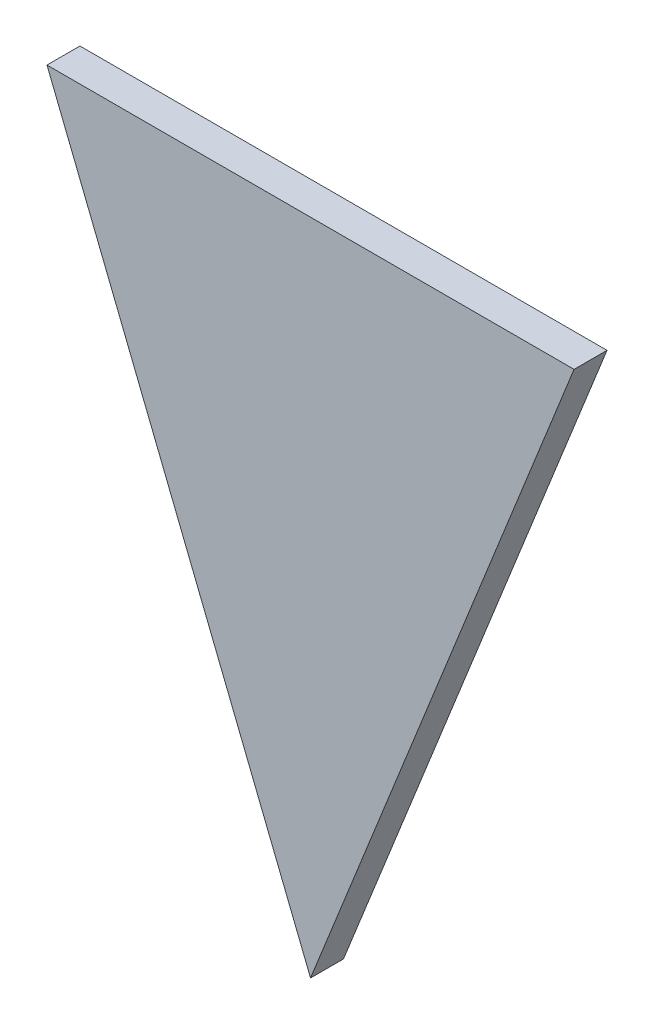
ISO-10303-21;
HEADER;
FILE_DESCRIPTION(('STEP AP214'),'2;1');
FILE_NAME('part.step','',(''),(''),'','','');
FILE_SCHEMA(('AUTOMOTIVE_DESIGN { 1 0 10303 214 1 1 1 1 }'));
ENDSEC;
DATA;
#1=APPLICATION_CONTEXT('core data for automotive mechanical design processes');
#2=APPLICATION_PROTOCOL_DEFINITION('international standard','automotive_design',2000,#1);
#3=PRODUCT_CONTEXT('',#1,'mechanical');
#4=PRODUCT('Part','Part','',(#3));
#5=PRODUCT_RELATED_PRODUCT_CATEGORY('part','',(#4));
#6=PRODUCT_DEFINITION_FORMATION('','',#4);
#7=PRODUCT_DEFINITION_CONTEXT('part definition',#1,'design');
#8=PRODUCT_DEFINITION('design','',#6,#7);
#9=PRODUCT_DEFINITION_SHAPE('','',#8);
#10=(LENGTH_UNIT() NAMED_UNIT(*) SI_UNIT(.MILLI.,.METRE.));
#11=(NAMED_UNIT(*) PLANE_ANGLE_UNIT() SI_UNIT($,.RADIAN.));
#12=(NAMED_UNIT(*) SI_UNIT($,.STERADIAN.) SOLID_ANGLE_UNIT());
#13=UNCERTAINTY_MEASURE_WITH_UNIT(LENGTH_MEASURE(1.E-05),#10,'distance_accuracy_value','');
#14=(GEOMETRIC_REPRESENTATION_CONTEXT(3) GLOBAL_UNCERTAINTY_ASSIGNED_CONTEXT((#13)) GLOBAL_UNIT_ASSIGNED_CONTEXT((#10,
#11,#12)) REPRESENTATION_CONTEXT('',''));
#15=CARTESIAN_POINT('',(0.,0.,0.));
#16=DIRECTION('',(0.,0.,1.));
#17=DIRECTION('',(1.,0.,0.));
#18=AXIS2_PLACEMENT_3D('',#15,#16,#17);
#19=CARTESIAN_POINT('',(0.,0.,0.));
#20=DIRECTION('',(0.,0.,1.));
#21=DIRECTION('',(1.,0.,0.));
#22=AXIS2_PLACEMENT_3D('',#19,#20,#21);
#23=PLANE('',#22);
#24=DIRECTION('',(-1.,0.,0.));
#25=VECTOR('',#24,1.);
#26=CARTESIAN_POINT('',(1.016,3.048,0.));
#27=LINE('',#26,#25);
#28=CARTESIAN_POINT('',(1.016,3.048,0.));
#29=VERTEX_POINT('',#28);
#30=CARTESIAN_POINT('',(-1.016,3.048,0.));
#31=VERTEX_POINT('',#30);
#32=EDGE_CURVE('E11',#29,#31,#27,.T.);
#33=ORIENTED_EDGE('',*,*,#32,.F.);
#34=DIRECTION('',(0.371390676354104,0.928476690885259,0.));
#35=VECTOR('',#34,1.);
#36=CARTESIAN_POINT('',(0.,0.508,0.));
#37=LINE('',#36,#35);
#38=CARTESIAN_POINT('',(0.,0.508,0.));
#39=VERTEX_POINT('',#38);
#40=EDGE_CURVE('E24',#39,#29,#37,.T.);
#41=ORIENTED_EDGE('',*,*,#40,.F.);
#42=DIRECTION('',(0.371390676354104,-0.928476690885259,0.));
#43=VECTOR('',#42,1.);
#44=CARTESIAN_POINT('',(-1.016,3.048,0.));
#45=LINE('',#44,#43);
#46=EDGE_CURVE('E81',#31,#39,#45,.T.);
#47=ORIENTED_EDGE('',*,*,#46,.F.);
#48=EDGE_LOOP('',(#33,#41,#47));
#49=FACE_BOUND('',#48,.T.);
#50=ADVANCED_FACE('F16',(#49),#23,.F.);
#51=CARTESIAN_POINT('',(-1.016,3.048,0.127));
#52=DIRECTION('',(0.928476690885259,0.371390676354104,0.));
#53=DIRECTION('',(-0.371390676354104,0.928476690885259,0.));
#54=AXIS2_PLACEMENT_3D('',#51,#52,#53);
#55=PLANE('',#54);
#56=ORIENTED_EDGE('',*,*,#46,.T.);
#57=DIRECTION('',(0.,0.,-1.));
#58=VECTOR('',#57,1.);
#59=CARTESIAN_POINT('',(0.,0.508,0.127));
#60=LINE('',#59,#58);
#61=CARTESIAN_POINT('',(0.,0.508,0.127));
#62=VERTEX_POINT('',#61);
#63=EDGE_CURVE('E77',#62,#39,#60,.T.);
#64=ORIENTED_EDGE('',*,*,#63,.F.);
#65=DIRECTION('',(0.371390676354104,-0.928476690885259,0.));
#66=VECTOR('',#65,1.);
#67=CARTESIAN_POINT('',(-1.016,3.048,0.127));
#68=LINE('',#67,#66);
#69=CARTESIAN_POINT('',(-1.016,3.048,0.127));
#70=VERTEX_POINT('',#69);
#71=EDGE_CURVE('E64',#70,#62,#68,.T.);
#72=ORIENTED_EDGE('',*,*,#71,.F.);
#73=DIRECTION('',(0.,0.,-1.));
#74=VECTOR('',#73,1.);
#75=CARTESIAN_POINT('',(-1.016,3.048,0.127));
#76=LINE('',#75,#74);
#77=EDGE_CURVE('E52',#70,#31,#76,.T.);
#78=ORIENTED_EDGE('',*,*,#77,.T.);
#79=EDGE_LOOP('',(#56,#64,#72,#78));
#80=FACE_BOUND('',#79,.T.);
#81=ADVANCED_FACE('F90',(#80),#55,.F.);
#82=CARTESIAN_POINT('',(1.016,3.048,0.127));
#83=DIRECTION('',(0.,-1.,0.));
#84=DIRECTION('',(0.,0.,-1.));
#85=AXIS2_PLACEMENT_3D('',#82,#83,#84);
#86=PLANE('',#85);
#87=ORIENTED_EDGE('',*,*,#32,.T.);
#88=ORIENTED_EDGE('',*,*,#77,.F.);
#89=DIRECTION('',(-1.,0.,0.));
#90=VECTOR('',#89,1.);
#91=CARTESIAN_POINT('',(1.016,3.048,0.127));
#92=LINE('',#91,#90);
#93=CARTESIAN_POINT('',(1.016,3.048,0.127));
#94=VERTEX_POINT('',#93);
#95=EDGE_CURVE('E47',#94,#70,#92,.T.);
#96=ORIENTED_EDGE('',*,*,#95,.F.);
#97=DIRECTION('',(0.,0.,-1.));
#98=VECTOR('',#97,1.);
#99=CARTESIAN_POINT('',(1.016,3.048,0.127));
#100=LINE('',#99,#98);
#101=EDGE_CURVE('E50',#94,#29,#100,.T.);
#102=ORIENTED_EDGE('',*,*,#101,.T.);
#103=EDGE_LOOP('',(#87,#88,#96,#102));
#104=FACE_BOUND('',#103,.T.);
#105=ADVANCED_FACE('F49',(#104),#86,.F.);
#106=CARTESIAN_POINT('',(0.,0.508,0.127));
#107=DIRECTION('',(-0.928476690885259,0.371390676354104,0.));
#108=DIRECTION('',(-0.371390676354104,-0.928476690885259,0.));
#109=AXIS2_PLACEMENT_3D('',#106,#107,#108);
#110=PLANE('',#109);
#111=ORIENTED_EDGE('',*,*,#40,.T.);
#112=ORIENTED_EDGE('',*,*,#101,.F.);
#113=DIRECTION('',(0.371390676354104,0.928476690885259,0.));
#114=VECTOR('',#113,1.);
#115=CARTESIAN_POINT('',(0.,0.508,0.127));
#116=LINE('',#115,#114);
#117=EDGE_CURVE('E61',#62,#94,#116,.T.);
#118=ORIENTED_EDGE('',*,*,#117,.F.);
#119=ORIENTED_EDGE('',*,*,#63,.T.);
#120=EDGE_LOOP('',(#111,#112,#118,#119));
#121=FACE_BOUND('',#120,.T.);
#122=ADVANCED_FACE('F59',(#121),#110,.F.);
#123=CARTESIAN_POINT('',(0.,0.,0.127));
#124=DIRECTION('',(0.,0.,1.));
#125=DIRECTION('',(1.,0.,0.));
#126=AXIS2_PLACEMENT_3D('',#123,#124,#125);
#127=PLANE('',#126);
#128=ORIENTED_EDGE('',*,*,#95,.T.);
#129=ORIENTED_EDGE('',*,*,#71,.T.);
#130=ORIENTED_EDGE('',*,*,#117,.T.);
#131=EDGE_LOOP('',(#128,#129,#130));
#132=FACE_BOUND('',#131,.T.);
#133=ADVANCED_FACE('F63',(#132),#127,.T.);
#134=CLOSED_SHELL('',(#50,#81,#105,#122,#133));
#135=MANIFOLD_SOLID_BREP('B1',#134);
#136=ADVANCED_BREP_SHAPE_REPRESENTATION('',(#18,#135),#14);
#137=SHAPE_DEFINITION_REPRESENTATION(#9,#136);
ENDSEC;
END-ISO-10303-21;
